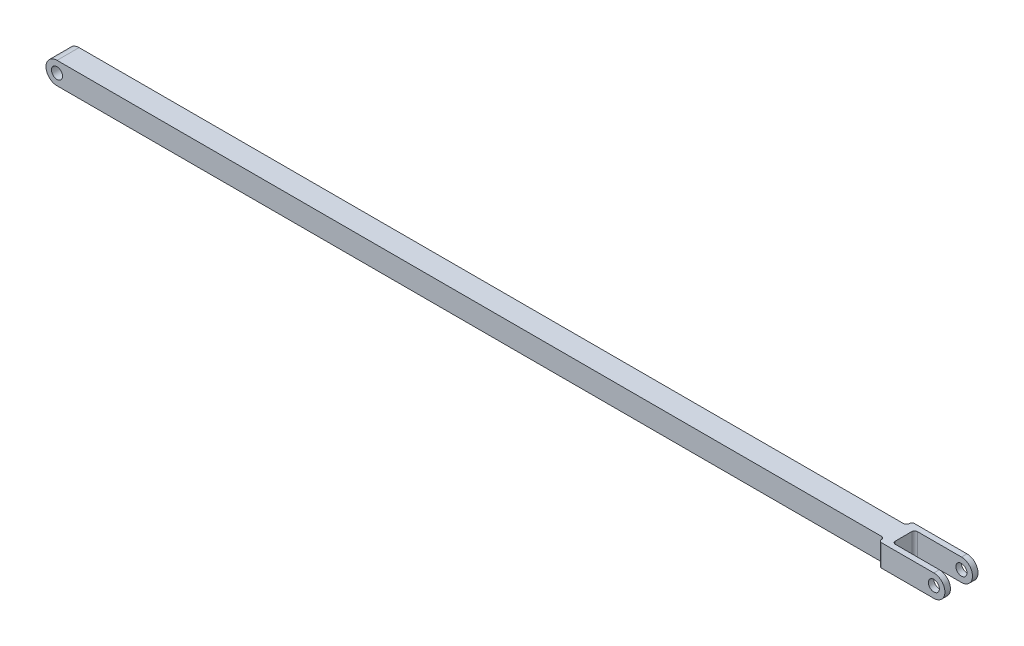
ISO-10303-21;
HEADER;
FILE_DESCRIPTION(('STEP AP214'),'2;1');
FILE_NAME('part.step','',(''),(''),'','','');
FILE_SCHEMA(('AUTOMOTIVE_DESIGN { 1 0 10303 214 1 1 1 1 }'));
ENDSEC;
DATA;
#1=APPLICATION_CONTEXT('core data for automotive mechanical design processes');
#2=APPLICATION_PROTOCOL_DEFINITION('international standard','automotive_design',2000,#1);
#3=PRODUCT_CONTEXT('',#1,'mechanical');
#4=PRODUCT('Part','Part','',(#3));
#5=PRODUCT_RELATED_PRODUCT_CATEGORY('part','',(#4));
#6=PRODUCT_DEFINITION_FORMATION('','',#4);
#7=PRODUCT_DEFINITION_CONTEXT('part definition',#1,'design');
#8=PRODUCT_DEFINITION('design','',#6,#7);
#9=PRODUCT_DEFINITION_SHAPE('','',#8);
#10=(LENGTH_UNIT() NAMED_UNIT(*) SI_UNIT(.MILLI.,.METRE.));
#11=(NAMED_UNIT(*) PLANE_ANGLE_UNIT() SI_UNIT($,.RADIAN.));
#12=(NAMED_UNIT(*) SI_UNIT($,.STERADIAN.) SOLID_ANGLE_UNIT());
#13=UNCERTAINTY_MEASURE_WITH_UNIT(LENGTH_MEASURE(1.E-05),#10,'distance_accuracy_value','');
#14=(GEOMETRIC_REPRESENTATION_CONTEXT(3) GLOBAL_UNCERTAINTY_ASSIGNED_CONTEXT((#13)) GLOBAL_UNIT_ASSIGNED_CONTEXT((#10,
#11,#12)) REPRESENTATION_CONTEXT('',''));
#15=CARTESIAN_POINT('',(0.,0.,0.));
#16=DIRECTION('',(0.,0.,1.));
#17=DIRECTION('',(1.,0.,0.));
#18=AXIS2_PLACEMENT_3D('',#15,#16,#17);
#19=CARTESIAN_POINT('',(520.7,-12.7,19.05));
#20=DIRECTION('',(0.,0.,-1.));
#21=DIRECTION('',(-1.,0.,0.));
#22=AXIS2_PLACEMENT_3D('',#19,#20,#21);
#23=PLANE('',#22);
#24=CARTESIAN_POINT('',(508.,0.,19.0500000000001));
#25=DIRECTION('',(0.,0.,1.));
#26=DIRECTION('',(1.,0.,0.));
#27=AXIS2_PLACEMENT_3D('',#24,#25,#26);
#28=CIRCLE('',#27,6.34999999999994);
#29=CARTESIAN_POINT('',(514.35,0.,19.0500000000001));
#30=VERTEX_POINT('',#29);
#31=EDGE_CURVE('E253',#30,#30,#28,.T.);
#32=ORIENTED_EDGE('',*,*,#31,.F.);
#33=EDGE_LOOP('',(#32));
#34=FACE_BOUND('',#33,.T.);
#35=DIRECTION('',(-1.,0.,0.));
#36=VECTOR('',#35,1.);
#37=CARTESIAN_POINT('',(520.7,12.7000000000002,19.05));
#38=LINE('',#37,#36);
#39=CARTESIAN_POINT('',(508.,12.7000000000002,19.0500000000001));
#40=VERTEX_POINT('',#39);
#41=CARTESIAN_POINT('',(447.675,12.7000000000002,19.05));
#42=VERTEX_POINT('',#41);
#43=EDGE_CURVE('E224',#40,#42,#38,.T.);
#44=ORIENTED_EDGE('',*,*,#43,.T.);
#45=DIRECTION('',(0.,1.,0.));
#46=VECTOR('',#45,1.);
#47=CARTESIAN_POINT('',(447.675,-12.7,19.05));
#48=LINE('',#47,#46);
#49=CARTESIAN_POINT('',(447.675,-12.7,19.05));
#50=VERTEX_POINT('',#49);
#51=EDGE_CURVE('E293',#42,#50,#48,.F.);
#52=ORIENTED_EDGE('',*,*,#51,.T.);
#53=DIRECTION('',(-1.,0.,0.));
#54=VECTOR('',#53,1.);
#55=CARTESIAN_POINT('',(520.7,-12.7,19.05));
#56=LINE('',#55,#54);
#57=CARTESIAN_POINT('',(508.,-12.7,19.0500000000001));
#58=VERTEX_POINT('',#57);
#59=EDGE_CURVE('E223',#58,#50,#56,.T.);
#60=ORIENTED_EDGE('',*,*,#59,.F.);
#61=CARTESIAN_POINT('',(508.,0.,19.0500000000001));
#62=DIRECTION('',(0.,0.,1.));
#63=DIRECTION('',(1.,0.,0.));
#64=AXIS2_PLACEMENT_3D('',#61,#62,#63);
#65=CIRCLE('',#64,12.6999999999999);
#66=EDGE_CURVE('E208',#58,#40,#65,.T.);
#67=ORIENTED_EDGE('',*,*,#66,.T.);
#68=EDGE_LOOP('',(#44,#52,#60,#67));
#69=FACE_BOUND('',#68,.T.);
#70=ADVANCED_FACE('F81',(#34,#69),#23,.F.);
#71=CARTESIAN_POINT('',(520.7,-12.7,-19.05));
#72=DIRECTION('',(0.,0.,-1.));
#73=DIRECTION('',(-1.,0.,0.));
#74=AXIS2_PLACEMENT_3D('',#71,#72,#73);
#75=PLANE('',#74);
#76=CARTESIAN_POINT('',(508.,0.,-19.05));
#77=DIRECTION('',(0.,0.,1.));
#78=DIRECTION('',(1.,0.,0.));
#79=AXIS2_PLACEMENT_3D('',#76,#77,#78);
#80=CIRCLE('',#79,6.34999999999994);
#81=CARTESIAN_POINT('',(514.35,0.,-19.05));
#82=VERTEX_POINT('',#81);
#83=EDGE_CURVE('E257',#82,#82,#80,.T.);
#84=ORIENTED_EDGE('',*,*,#83,.T.);
#85=EDGE_LOOP('',(#84));
#86=FACE_BOUND('',#85,.T.);
#87=DIRECTION('',(-1.,0.,0.));
#88=VECTOR('',#87,1.);
#89=CARTESIAN_POINT('',(520.7,-12.7,-19.05));
#90=LINE('',#89,#88);
#91=CARTESIAN_POINT('',(508.,-12.7,-19.05));
#92=VERTEX_POINT('',#91);
#93=CARTESIAN_POINT('',(447.675,-12.7,-19.05));
#94=VERTEX_POINT('',#93);
#95=EDGE_CURVE('E227',#92,#94,#90,.T.);
#96=ORIENTED_EDGE('',*,*,#95,.T.);
#97=DIRECTION('',(0.,1.,0.));
#98=VECTOR('',#97,1.);
#99=CARTESIAN_POINT('',(447.675,-12.7,-19.05));
#100=LINE('',#99,#98);
#101=CARTESIAN_POINT('',(447.675,12.7000000000002,-19.05));
#102=VERTEX_POINT('',#101);
#103=EDGE_CURVE('E222',#94,#102,#100,.T.);
#104=ORIENTED_EDGE('',*,*,#103,.T.);
#105=DIRECTION('',(-1.,0.,0.));
#106=VECTOR('',#105,1.);
#107=CARTESIAN_POINT('',(520.7,12.7000000000002,-19.05));
#108=LINE('',#107,#106);
#109=CARTESIAN_POINT('',(508.,12.7000000000002,-19.05));
#110=VERTEX_POINT('',#109);
#111=EDGE_CURVE('E213',#110,#102,#108,.T.);
#112=ORIENTED_EDGE('',*,*,#111,.F.);
#113=CARTESIAN_POINT('',(508.,0.,-19.05));
#114=DIRECTION('',(0.,0.,1.));
#115=DIRECTION('',(1.,0.,0.));
#116=AXIS2_PLACEMENT_3D('',#113,#114,#115);
#117=CIRCLE('',#116,12.6999999999999);
#118=EDGE_CURVE('E196',#92,#110,#117,.T.);
#119=ORIENTED_EDGE('',*,*,#118,.F.);
#120=EDGE_LOOP('',(#96,#104,#112,#119));
#121=FACE_BOUND('',#120,.T.);
#122=ADVANCED_FACE('F220',(#86,#121),#75,.T.);
#123=CARTESIAN_POINT('',(454.025,-12.7,-12.7));
#124=DIRECTION('',(0.,0.,1.));
#125=DIRECTION('',(1.,0.,0.));
#126=AXIS2_PLACEMENT_3D('',#123,#124,#125);
#127=PLANE('',#126);
#128=CARTESIAN_POINT('',(508.,0.,-12.7));
#129=DIRECTION('',(0.,0.,1.));
#130=DIRECTION('',(1.,0.,0.));
#131=AXIS2_PLACEMENT_3D('',#128,#129,#130);
#132=CIRCLE('',#131,6.34999999999994);
#133=CARTESIAN_POINT('',(514.35,0.,-12.7));
#134=VERTEX_POINT('',#133);
#135=EDGE_CURVE('E217',#134,#134,#132,.T.);
#136=ORIENTED_EDGE('',*,*,#135,.F.);
#137=EDGE_LOOP('',(#136));
#138=FACE_BOUND('',#137,.T.);
#139=DIRECTION('',(1.,0.,0.));
#140=VECTOR('',#139,1.);
#141=CARTESIAN_POINT('',(454.025,12.7000000000002,-12.7));
#142=LINE('',#141,#140);
#143=CARTESIAN_POINT('',(457.2,12.7000000000002,-12.7));
#144=VERTEX_POINT('',#143);
#145=CARTESIAN_POINT('',(508.,12.7000000000002,-12.7));
#146=VERTEX_POINT('',#145);
#147=EDGE_CURVE('E215',#144,#146,#142,.T.);
#148=ORIENTED_EDGE('',*,*,#147,.F.);
#149=DIRECTION('',(0.,1.,0.));
#150=VECTOR('',#149,1.);
#151=CARTESIAN_POINT('',(457.2,-12.7,-12.7));
#152=LINE('',#151,#150);
#153=CARTESIAN_POINT('',(457.2,-12.7,-12.7));
#154=VERTEX_POINT('',#153);
#155=EDGE_CURVE('E291',#144,#154,#152,.F.);
#156=ORIENTED_EDGE('',*,*,#155,.T.);
#157=DIRECTION('',(1.,0.,0.));
#158=VECTOR('',#157,1.);
#159=CARTESIAN_POINT('',(454.025,-12.7,-12.7));
#160=LINE('',#159,#158);
#161=CARTESIAN_POINT('',(508.,-12.7,-12.7));
#162=VERTEX_POINT('',#161);
#163=EDGE_CURVE('E230',#154,#162,#160,.T.);
#164=ORIENTED_EDGE('',*,*,#163,.T.);
#165=CARTESIAN_POINT('',(508.,0.,-12.7));
#166=DIRECTION('',(0.,0.,1.));
#167=DIRECTION('',(1.,0.,0.));
#168=AXIS2_PLACEMENT_3D('',#165,#166,#167);
#169=CIRCLE('',#168,12.6999999999999);
#170=EDGE_CURVE('E369',#162,#146,#169,.T.);
#171=ORIENTED_EDGE('',*,*,#170,.T.);
#172=EDGE_LOOP('',(#148,#156,#164,#171));
#173=FACE_BOUND('',#172,.T.);
#174=ADVANCED_FACE('F403',(#138,#173),#127,.T.);
#175=CARTESIAN_POINT('',(454.025,-12.7,12.7));
#176=DIRECTION('',(0.,0.,1.));
#177=DIRECTION('',(1.,0.,0.));
#178=AXIS2_PLACEMENT_3D('',#175,#176,#177);
#179=PLANE('',#178);
#180=CARTESIAN_POINT('',(508.,0.,12.7));
#181=DIRECTION('',(0.,0.,1.));
#182=DIRECTION('',(1.,0.,0.));
#183=AXIS2_PLACEMENT_3D('',#180,#181,#182);
#184=CIRCLE('',#183,6.34999999999994);
#185=CARTESIAN_POINT('',(514.35,0.,12.7));
#186=VERTEX_POINT('',#185);
#187=EDGE_CURVE('E256',#186,#186,#184,.T.);
#188=ORIENTED_EDGE('',*,*,#187,.T.);
#189=EDGE_LOOP('',(#188));
#190=FACE_BOUND('',#189,.T.);
#191=DIRECTION('',(1.,0.,0.));
#192=VECTOR('',#191,1.);
#193=CARTESIAN_POINT('',(454.025,-12.7,12.7));
#194=LINE('',#193,#192);
#195=CARTESIAN_POINT('',(457.2,-12.7,12.7));
#196=VERTEX_POINT('',#195);
#197=CARTESIAN_POINT('',(508.,-12.7,12.7));
#198=VERTEX_POINT('',#197);
#199=EDGE_CURVE('E367',#196,#198,#194,.T.);
#200=ORIENTED_EDGE('',*,*,#199,.F.);
#201=DIRECTION('',(0.,1.,0.));
#202=VECTOR('',#201,1.);
#203=CARTESIAN_POINT('',(457.2,12.7000000000002,12.7));
#204=LINE('',#203,#202);
#205=CARTESIAN_POINT('',(457.2,12.7000000000002,12.7));
#206=VERTEX_POINT('',#205);
#207=EDGE_CURVE('E269',#196,#206,#204,.T.);
#208=ORIENTED_EDGE('',*,*,#207,.T.);
#209=DIRECTION('',(1.,0.,0.));
#210=VECTOR('',#209,1.);
#211=CARTESIAN_POINT('',(454.025,12.7000000000002,12.7));
#212=LINE('',#211,#210);
#213=CARTESIAN_POINT('',(508.,12.7000000000002,12.7));
#214=VERTEX_POINT('',#213);
#215=EDGE_CURVE('E380',#206,#214,#212,.T.);
#216=ORIENTED_EDGE('',*,*,#215,.T.);
#217=CARTESIAN_POINT('',(508.,0.,12.7));
#218=DIRECTION('',(0.,0.,1.));
#219=DIRECTION('',(1.,0.,0.));
#220=AXIS2_PLACEMENT_3D('',#217,#218,#219);
#221=CIRCLE('',#220,12.6999999999999);
#222=EDGE_CURVE('E335',#198,#214,#221,.T.);
#223=ORIENTED_EDGE('',*,*,#222,.F.);
#224=EDGE_LOOP('',(#200,#208,#216,#223));
#225=FACE_BOUND('',#224,.T.);
#226=ADVANCED_FACE('F434',(#190,#225),#179,.F.);
#227=CARTESIAN_POINT('',(-508.,12.7,12.7));
#228=DIRECTION('',(0.,-1.,0.));
#229=DIRECTION('',(1.,0.,0.));
#230=AXIS2_PLACEMENT_3D('',#227,#228,#229);
#231=PLANE('',#230);
#232=ORIENTED_EDGE('',*,*,#111,.T.);
#233=CARTESIAN_POINT('',(447.675,12.7000000000002,-15.875));
#234=DIRECTION('',(0.,-1.,0.));
#235=DIRECTION('',(1.,0.,0.));
#236=AXIS2_PLACEMENT_3D('',#233,#234,#235);
#237=CIRCLE('',#236,3.175);
#238=CARTESIAN_POINT('',(444.5,12.7000000000002,-15.875));
#239=VERTEX_POINT('',#238);
#240=EDGE_CURVE('E281',#102,#239,#237,.F.);
#241=ORIENTED_EDGE('',*,*,#240,.T.);
#242=CARTESIAN_POINT('',(441.325,12.7000000000002,-15.875));
#243=DIRECTION('',(0.,-1.,0.));
#244=DIRECTION('',(1.,0.,0.));
#245=AXIS2_PLACEMENT_3D('',#242,#243,#244);
#246=CIRCLE('',#245,3.175);
#247=CARTESIAN_POINT('',(441.325,12.7000000000002,-12.7));
#248=VERTEX_POINT('',#247);
#249=EDGE_CURVE('E300',#239,#248,#246,.T.);
#250=ORIENTED_EDGE('',*,*,#249,.T.);
#251=DIRECTION('',(-1.,0.,0.));
#252=VECTOR('',#251,1.);
#253=CARTESIAN_POINT('',(-508.,12.7,-12.7));
#254=LINE('',#253,#252);
#255=CARTESIAN_POINT('',(-508.,12.7,-12.7));
#256=VERTEX_POINT('',#255);
#257=EDGE_CURVE('E345',#248,#256,#254,.T.);
#258=ORIENTED_EDGE('',*,*,#257,.T.);
#259=DIRECTION('',(0.,0.,-1.));
#260=VECTOR('',#259,1.);
#261=CARTESIAN_POINT('',(-508.,12.7,12.7));
#262=LINE('',#261,#260);
#263=CARTESIAN_POINT('',(-508.,12.7,12.7));
#264=VERTEX_POINT('',#263);
#265=EDGE_CURVE('E339',#264,#256,#262,.T.);
#266=ORIENTED_EDGE('',*,*,#265,.F.);
#267=DIRECTION('',(-1.,0.,0.));
#268=VECTOR('',#267,1.);
#269=CARTESIAN_POINT('',(-508.,12.7,12.7));
#270=LINE('',#269,#268);
#271=CARTESIAN_POINT('',(441.325,12.7000000000002,12.7));
#272=VERTEX_POINT('',#271);
#273=EDGE_CURVE('E344',#272,#264,#270,.T.);
#274=ORIENTED_EDGE('',*,*,#273,.F.);
#275=CARTESIAN_POINT('',(441.325,12.7000000000002,15.875));
#276=DIRECTION('',(0.,-1.,0.));
#277=DIRECTION('',(1.,0.,0.));
#278=AXIS2_PLACEMENT_3D('',#275,#276,#277);
#279=CIRCLE('',#278,3.175);
#280=CARTESIAN_POINT('',(444.5,12.7000000000002,15.875));
#281=VERTEX_POINT('',#280);
#282=EDGE_CURVE('E304',#272,#281,#279,.T.);
#283=ORIENTED_EDGE('',*,*,#282,.T.);
#284=CARTESIAN_POINT('',(447.675,12.7000000000002,15.875));
#285=DIRECTION('',(0.,-1.,0.));
#286=DIRECTION('',(1.,0.,0.));
#287=AXIS2_PLACEMENT_3D('',#284,#285,#286);
#288=CIRCLE('',#287,3.175);
#289=EDGE_CURVE('E279',#281,#42,#288,.F.);
#290=ORIENTED_EDGE('',*,*,#289,.T.);
#291=ORIENTED_EDGE('',*,*,#43,.F.);
#292=DIRECTION('',(0.,0.,1.));
#293=VECTOR('',#292,1.);
#294=CARTESIAN_POINT('',(508.,12.7,-19.05));
#295=LINE('',#294,#293);
#296=EDGE_CURVE('E267',#214,#40,#295,.T.);
#297=ORIENTED_EDGE('',*,*,#296,.F.);
#298=ORIENTED_EDGE('',*,*,#215,.F.);
#299=CARTESIAN_POINT('',(457.2,12.7000000000002,9.52499999999998));
#300=DIRECTION('',(0.,-1.,0.));
#301=DIRECTION('',(1.,0.,0.));
#302=AXIS2_PLACEMENT_3D('',#299,#300,#301);
#303=CIRCLE('',#302,3.175);
#304=CARTESIAN_POINT('',(454.025,12.7000000000002,9.52499999999997));
#305=VERTEX_POINT('',#304);
#306=EDGE_CURVE('E295',#206,#305,#303,.T.);
#307=ORIENTED_EDGE('',*,*,#306,.T.);
#308=DIRECTION('',(0.,0.,1.));
#309=VECTOR('',#308,1.);
#310=CARTESIAN_POINT('',(454.025,12.7000000000002,-12.7));
#311=LINE('',#310,#309);
#312=CARTESIAN_POINT('',(454.025,12.7000000000002,-9.52500000000003));
#313=VERTEX_POINT('',#312);
#314=EDGE_CURVE('E372',#313,#305,#311,.T.);
#315=ORIENTED_EDGE('',*,*,#314,.F.);
#316=CARTESIAN_POINT('',(457.2,12.7000000000002,-9.52500000000003));
#317=DIRECTION('',(0.,-1.,0.));
#318=DIRECTION('',(1.,0.,0.));
#319=AXIS2_PLACEMENT_3D('',#316,#317,#318);
#320=CIRCLE('',#319,3.175);
#321=EDGE_CURVE('E90',#313,#144,#320,.T.);
#322=ORIENTED_EDGE('',*,*,#321,.T.);
#323=ORIENTED_EDGE('',*,*,#147,.T.);
#324=DIRECTION('',(0.,0.,1.));
#325=VECTOR('',#324,1.);
#326=CARTESIAN_POINT('',(508.,12.7000000000002,-19.05));
#327=LINE('',#326,#325);
#328=EDGE_CURVE('E200',#110,#146,#327,.T.);
#329=ORIENTED_EDGE('',*,*,#328,.F.);
#330=EDGE_LOOP('',(#232,#241,#250,#258,#266,#274,#283,#290,#291,#297,#298,#307,#315,#322,#323,#329));
#331=FACE_BOUND('',#330,.T.);
#332=ADVANCED_FACE('F212',(#331),#231,.F.);
#333=CARTESIAN_POINT('',(-508.,-12.7,12.7));
#334=DIRECTION('',(0.,1.,0.));
#335=DIRECTION('',(-1.,0.,0.));
#336=AXIS2_PLACEMENT_3D('',#333,#334,#335);
#337=PLANE('',#336);
#338=DIRECTION('',(1.,0.,0.));
#339=VECTOR('',#338,1.);
#340=CARTESIAN_POINT('',(-508.,-12.7,-12.7));
#341=LINE('',#340,#339);
#342=CARTESIAN_POINT('',(-508.,-12.7,-12.7));
#343=VERTEX_POINT('',#342);
#344=CARTESIAN_POINT('',(441.325,-12.6999999999998,-12.7));
#345=VERTEX_POINT('',#344);
#346=EDGE_CURVE('E348',#343,#345,#341,.T.);
#347=ORIENTED_EDGE('',*,*,#346,.T.);
#348=CARTESIAN_POINT('',(441.325,-12.6999999999998,-15.875));
#349=DIRECTION('',(0.,1.,0.));
#350=DIRECTION('',(-1.,0.,0.));
#351=AXIS2_PLACEMENT_3D('',#348,#349,#350);
#352=CIRCLE('',#351,3.175);
#353=CARTESIAN_POINT('',(444.5,-12.7,-15.875));
#354=VERTEX_POINT('',#353);
#355=EDGE_CURVE('E98',#345,#354,#352,.T.);
#356=ORIENTED_EDGE('',*,*,#355,.T.);
#357=CARTESIAN_POINT('',(447.675,-12.6999999999998,-15.875));
#358=DIRECTION('',(0.,1.,0.));
#359=DIRECTION('',(-1.,0.,0.));
#360=AXIS2_PLACEMENT_3D('',#357,#358,#359);
#361=CIRCLE('',#360,3.175);
#362=EDGE_CURVE('E285',#354,#94,#361,.F.);
#363=ORIENTED_EDGE('',*,*,#362,.T.);
#364=ORIENTED_EDGE('',*,*,#95,.F.);
#365=DIRECTION('',(0.,0.,1.));
#366=VECTOR('',#365,1.);
#367=CARTESIAN_POINT('',(508.,-12.7,-19.05));
#368=LINE('',#367,#366);
#369=EDGE_CURVE('E202',#92,#162,#368,.T.);
#370=ORIENTED_EDGE('',*,*,#369,.T.);
#371=ORIENTED_EDGE('',*,*,#163,.F.);
#372=CARTESIAN_POINT('',(457.2,-12.6999999999998,-9.52500000000003));
#373=DIRECTION('',(0.,1.,0.));
#374=DIRECTION('',(-1.,0.,0.));
#375=AXIS2_PLACEMENT_3D('',#372,#373,#374);
#376=CIRCLE('',#375,3.175);
#377=CARTESIAN_POINT('',(454.025,-12.7,-9.52500000000003));
#378=VERTEX_POINT('',#377);
#379=EDGE_CURVE('E13',#154,#378,#376,.T.);
#380=ORIENTED_EDGE('',*,*,#379,.T.);
#381=DIRECTION('',(0.,0.,1.));
#382=VECTOR('',#381,1.);
#383=CARTESIAN_POINT('',(454.025,-12.7,-12.7));
#384=LINE('',#383,#382);
#385=CARTESIAN_POINT('',(454.025,-12.7,9.52499999999997));
#386=VERTEX_POINT('',#385);
#387=EDGE_CURVE('E373',#378,#386,#384,.T.);
#388=ORIENTED_EDGE('',*,*,#387,.T.);
#389=CARTESIAN_POINT('',(457.2,-12.6999999999998,9.52499999999998));
#390=DIRECTION('',(0.,1.,0.));
#391=DIRECTION('',(-1.,0.,0.));
#392=AXIS2_PLACEMENT_3D('',#389,#390,#391);
#393=CIRCLE('',#392,3.175);
#394=EDGE_CURVE('E297',#386,#196,#393,.T.);
#395=ORIENTED_EDGE('',*,*,#394,.T.);
#396=ORIENTED_EDGE('',*,*,#199,.T.);
#397=EDGE_CURVE('E207',#198,#58,#368,.T.);
#398=ORIENTED_EDGE('',*,*,#397,.T.);
#399=ORIENTED_EDGE('',*,*,#59,.T.);
#400=CARTESIAN_POINT('',(447.675,-12.6999999999998,15.875));
#401=DIRECTION('',(0.,1.,0.));
#402=DIRECTION('',(-1.,0.,0.));
#403=AXIS2_PLACEMENT_3D('',#400,#401,#402);
#404=CIRCLE('',#403,3.175);
#405=CARTESIAN_POINT('',(444.5,-12.7,15.875));
#406=VERTEX_POINT('',#405);
#407=EDGE_CURVE('E283',#50,#406,#404,.F.);
#408=ORIENTED_EDGE('',*,*,#407,.T.);
#409=CARTESIAN_POINT('',(441.325,-12.6999999999998,15.875));
#410=DIRECTION('',(0.,1.,0.));
#411=DIRECTION('',(-1.,0.,0.));
#412=AXIS2_PLACEMENT_3D('',#409,#410,#411);
#413=CIRCLE('',#412,3.175);
#414=CARTESIAN_POINT('',(441.325,-12.6999999999998,12.7));
#415=VERTEX_POINT('',#414);
#416=EDGE_CURVE('E302',#406,#415,#413,.T.);
#417=ORIENTED_EDGE('',*,*,#416,.T.);
#418=DIRECTION('',(1.,0.,0.));
#419=VECTOR('',#418,1.);
#420=CARTESIAN_POINT('',(-508.,-12.7,12.7));
#421=LINE('',#420,#419);
#422=CARTESIAN_POINT('',(-508.,-12.7,12.7));
#423=VERTEX_POINT('',#422);
#424=EDGE_CURVE('E353',#423,#415,#421,.T.);
#425=ORIENTED_EDGE('',*,*,#424,.F.);
#426=DIRECTION('',(0.,0.,-1.));
#427=VECTOR('',#426,1.);
#428=CARTESIAN_POINT('',(-508.,-12.7,12.7));
#429=LINE('',#428,#427);
#430=EDGE_CURVE('E337',#423,#343,#429,.T.);
#431=ORIENTED_EDGE('',*,*,#430,.T.);
#432=EDGE_LOOP('',(#347,#356,#363,#364,#370,#371,#380,#388,#395,#396,#398,#399,#408,#417,#425,#431));
#433=FACE_BOUND('',#432,.T.);
#434=ADVANCED_FACE('F365',(#433),#337,.F.);
#435=CARTESIAN_POINT('',(-508.,0.,12.7));
#436=DIRECTION('',(0.,0.,-1.));
#437=DIRECTION('',(-1.,0.,0.));
#438=AXIS2_PLACEMENT_3D('',#435,#436,#437);
#439=CYLINDRICAL_SURFACE('',#438,12.7);
#440=CARTESIAN_POINT('',(-508.,0.,-12.7));
#441=DIRECTION('',(0.,0.,1.));
#442=DIRECTION('',(1.,0.,0.));
#443=AXIS2_PLACEMENT_3D('',#440,#441,#442);
#444=CIRCLE('',#443,12.7);
#445=EDGE_CURVE('E238',#256,#343,#444,.T.);
#446=ORIENTED_EDGE('',*,*,#445,.T.);
#447=ORIENTED_EDGE('',*,*,#430,.F.);
#448=CARTESIAN_POINT('',(-508.,0.,12.7));
#449=DIRECTION('',(0.,0.,1.));
#450=DIRECTION('',(1.,0.,0.));
#451=AXIS2_PLACEMENT_3D('',#448,#449,#450);
#452=CIRCLE('',#451,12.7);
#453=EDGE_CURVE('E347',#264,#423,#452,.T.);
#454=ORIENTED_EDGE('',*,*,#453,.F.);
#455=ORIENTED_EDGE('',*,*,#265,.T.);
#456=EDGE_LOOP('',(#446,#447,#454,#455));
#457=FACE_BOUND('',#456,.T.);
#458=ADVANCED_FACE('F363',(#457),#439,.T.);
#459=CARTESIAN_POINT('',(-508.,0.,12.7));
#460=DIRECTION('',(0.,0.,1.));
#461=DIRECTION('',(1.,0.,0.));
#462=AXIS2_PLACEMENT_3D('',#459,#460,#461);
#463=PLANE('',#462);
#464=ORIENTED_EDGE('',*,*,#424,.T.);
#465=DIRECTION('',(0.,-1.,0.));
#466=VECTOR('',#465,1.);
#467=CARTESIAN_POINT('',(441.325,12.7000000000002,12.7));
#468=LINE('',#467,#466);
#469=EDGE_CURVE('E288',#415,#272,#468,.F.);
#470=ORIENTED_EDGE('',*,*,#469,.T.);
#471=ORIENTED_EDGE('',*,*,#273,.T.);
#472=ORIENTED_EDGE('',*,*,#453,.T.);
#473=EDGE_LOOP('',(#464,#470,#471,#472));
#474=FACE_BOUND('',#473,.T.);
#475=CARTESIAN_POINT('',(-508.,0.,12.7));
#476=DIRECTION('',(0.,0.,1.));
#477=DIRECTION('',(1.,0.,0.));
#478=AXIS2_PLACEMENT_3D('',#475,#476,#477);
#479=CIRCLE('',#478,6.35000000000017);
#480=CARTESIAN_POINT('',(-501.65,0.,12.7));
#481=VERTEX_POINT('',#480);
#482=EDGE_CURVE('E239',#481,#481,#479,.T.);
#483=ORIENTED_EDGE('',*,*,#482,.F.);
#484=EDGE_LOOP('',(#483));
#485=FACE_BOUND('',#484,.T.);
#486=ADVANCED_FACE('F359',(#474,#485),#463,.T.);
#487=CARTESIAN_POINT('',(-508.,0.,-12.7));
#488=DIRECTION('',(0.,0.,1.));
#489=DIRECTION('',(1.,0.,0.));
#490=AXIS2_PLACEMENT_3D('',#487,#488,#489);
#491=PLANE('',#490);
#492=CARTESIAN_POINT('',(-508.,0.,-12.7));
#493=DIRECTION('',(0.,0.,1.));
#494=DIRECTION('',(1.,0.,0.));
#495=AXIS2_PLACEMENT_3D('',#492,#493,#494);
#496=CIRCLE('',#495,6.35000000000017);
#497=CARTESIAN_POINT('',(-501.65,0.,-12.7));
#498=VERTEX_POINT('',#497);
#499=EDGE_CURVE('E234',#498,#498,#496,.T.);
#500=ORIENTED_EDGE('',*,*,#499,.T.);
#501=EDGE_LOOP('',(#500));
#502=FACE_BOUND('',#501,.T.);
#503=ORIENTED_EDGE('',*,*,#257,.F.);
#504=DIRECTION('',(0.,-1.,0.));
#505=VECTOR('',#504,1.);
#506=CARTESIAN_POINT('',(441.325,1.72894106439022E-13,-12.7));
#507=LINE('',#506,#505);
#508=EDGE_CURVE('E106',#248,#345,#507,.T.);
#509=ORIENTED_EDGE('',*,*,#508,.T.);
#510=ORIENTED_EDGE('',*,*,#346,.F.);
#511=ORIENTED_EDGE('',*,*,#445,.F.);
#512=EDGE_LOOP('',(#503,#509,#510,#511));
#513=FACE_BOUND('',#512,.T.);
#514=ADVANCED_FACE('F387',(#502,#513),#491,.F.);
#515=CARTESIAN_POINT('',(-508.,0.,-12.7));
#516=DIRECTION('',(0.,0.,1.));
#517=DIRECTION('',(1.,0.,0.));
#518=AXIS2_PLACEMENT_3D('',#515,#516,#517);
#519=CYLINDRICAL_SURFACE('',#518,6.35000000000017);
#520=ORIENTED_EDGE('',*,*,#499,.F.);
#521=EDGE_LOOP('',(#520));
#522=FACE_BOUND('',#521,.T.);
#523=ORIENTED_EDGE('',*,*,#482,.T.);
#524=EDGE_LOOP('',(#523));
#525=FACE_BOUND('',#524,.T.);
#526=ADVANCED_FACE('F385',(#522,#525),#519,.F.);
#527=CARTESIAN_POINT('',(454.025,-12.7,-12.7));
#528=DIRECTION('',(-1.,0.,0.));
#529=DIRECTION('',(0.,-1.,0.));
#530=AXIS2_PLACEMENT_3D('',#527,#528,#529);
#531=PLANE('',#530);
#532=ORIENTED_EDGE('',*,*,#314,.T.);
#533=DIRECTION('',(0.,1.,0.));
#534=VECTOR('',#533,1.);
#535=CARTESIAN_POINT('',(454.025,-12.7,9.52499999999998));
#536=LINE('',#535,#534);
#537=EDGE_CURVE('E276',#305,#386,#536,.F.);
#538=ORIENTED_EDGE('',*,*,#537,.T.);
#539=ORIENTED_EDGE('',*,*,#387,.F.);
#540=DIRECTION('',(0.,1.,0.));
#541=VECTOR('',#540,1.);
#542=CARTESIAN_POINT('',(454.025,-12.7,-9.52500000000003));
#543=LINE('',#542,#541);
#544=EDGE_CURVE('E273',#378,#313,#543,.T.);
#545=ORIENTED_EDGE('',*,*,#544,.T.);
#546=EDGE_LOOP('',(#532,#538,#539,#545));
#547=FACE_BOUND('',#546,.T.);
#548=ADVANCED_FACE('F409',(#547),#531,.F.);
#549=CARTESIAN_POINT('',(508.,0.,-19.05));
#550=DIRECTION('',(0.,0.,1.));
#551=DIRECTION('',(1.,0.,0.));
#552=AXIS2_PLACEMENT_3D('',#549,#550,#551);
#553=CYLINDRICAL_SURFACE('',#552,12.6999999999999);
#554=ORIENTED_EDGE('',*,*,#222,.T.);
#555=ORIENTED_EDGE('',*,*,#296,.T.);
#556=ORIENTED_EDGE('',*,*,#66,.F.);
#557=ORIENTED_EDGE('',*,*,#397,.F.);
#558=EDGE_LOOP('',(#554,#555,#556,#557));
#559=FACE_BOUND('',#558,.T.);
#560=ADVANCED_FACE('F333',(#559),#553,.T.);
#561=ORIENTED_EDGE('',*,*,#369,.F.);
#562=ORIENTED_EDGE('',*,*,#118,.T.);
#563=ORIENTED_EDGE('',*,*,#328,.T.);
#564=ORIENTED_EDGE('',*,*,#170,.F.);
#565=EDGE_LOOP('',(#561,#562,#563,#564));
#566=FACE_BOUND('',#565,.T.);
#567=ADVANCED_FACE('F198',(#566),#553,.T.);
#568=CARTESIAN_POINT('',(508.,0.,-19.05));
#569=DIRECTION('',(0.,0.,1.));
#570=DIRECTION('',(1.,0.,0.));
#571=AXIS2_PLACEMENT_3D('',#568,#569,#570);
#572=CYLINDRICAL_SURFACE('',#571,6.34999999999994);
#573=ORIENTED_EDGE('',*,*,#31,.T.);
#574=EDGE_LOOP('',(#573));
#575=FACE_BOUND('',#574,.T.);
#576=ORIENTED_EDGE('',*,*,#187,.F.);
#577=EDGE_LOOP('',(#576));
#578=FACE_BOUND('',#577,.T.);
#579=ADVANCED_FACE('F448',(#575,#578),#572,.F.);
#580=ORIENTED_EDGE('',*,*,#135,.T.);
#581=EDGE_LOOP('',(#580));
#582=FACE_BOUND('',#581,.T.);
#583=ORIENTED_EDGE('',*,*,#83,.F.);
#584=EDGE_LOOP('',(#583));
#585=FACE_BOUND('',#584,.T.);
#586=ADVANCED_FACE('F449',(#582,#585),#572,.F.);
#587=CARTESIAN_POINT('',(457.2,-12.7,9.52499999999998));
#588=DIRECTION('',(0.,-1.,0.));
#589=DIRECTION('',(1.,0.,0.));
#590=AXIS2_PLACEMENT_3D('',#587,#588,#589);
#591=CYLINDRICAL_SURFACE('',#590,3.175);
#592=ORIENTED_EDGE('',*,*,#394,.F.);
#593=ORIENTED_EDGE('',*,*,#537,.F.);
#594=ORIENTED_EDGE('',*,*,#306,.F.);
#595=ORIENTED_EDGE('',*,*,#207,.F.);
#596=EDGE_LOOP('',(#592,#593,#594,#595));
#597=FACE_BOUND('',#596,.T.);
#598=ADVANCED_FACE('F432',(#597),#591,.F.);
#599=CARTESIAN_POINT('',(441.325,1.72894106439022E-13,-15.875));
#600=DIRECTION('',(0.,-1.,0.));
#601=DIRECTION('',(1.,0.,0.));
#602=AXIS2_PLACEMENT_3D('',#599,#600,#601);
#603=CYLINDRICAL_SURFACE('',#602,3.175);
#604=DIRECTION('',(0.,-1.,0.));
#605=VECTOR('',#604,1.);
#606=CARTESIAN_POINT('',(444.5,-12.7,-15.875));
#607=LINE('',#606,#605);
#608=EDGE_CURVE('E306',#354,#239,#607,.F.);
#609=ORIENTED_EDGE('',*,*,#608,.F.);
#610=ORIENTED_EDGE('',*,*,#355,.F.);
#611=ORIENTED_EDGE('',*,*,#508,.F.);
#612=ORIENTED_EDGE('',*,*,#249,.F.);
#613=EDGE_LOOP('',(#609,#610,#611,#612));
#614=FACE_BOUND('',#613,.T.);
#615=ADVANCED_FACE('F418',(#614),#603,.F.);
#616=CARTESIAN_POINT('',(447.675,-12.7,-15.875));
#617=DIRECTION('',(0.,1.,0.));
#618=DIRECTION('',(-1.,0.,0.));
#619=AXIS2_PLACEMENT_3D('',#616,#617,#618);
#620=CYLINDRICAL_SURFACE('',#619,3.175);
#621=ORIENTED_EDGE('',*,*,#362,.F.);
#622=ORIENTED_EDGE('',*,*,#608,.T.);
#623=ORIENTED_EDGE('',*,*,#240,.F.);
#624=ORIENTED_EDGE('',*,*,#103,.F.);
#625=EDGE_LOOP('',(#621,#622,#623,#624));
#626=FACE_BOUND('',#625,.T.);
#627=ADVANCED_FACE('F419',(#626),#620,.T.);
#628=CARTESIAN_POINT('',(447.675,-12.7,15.875));
#629=DIRECTION('',(0.,-1.,0.));
#630=DIRECTION('',(1.,0.,0.));
#631=AXIS2_PLACEMENT_3D('',#628,#629,#630);
#632=CYLINDRICAL_SURFACE('',#631,3.175);
#633=ORIENTED_EDGE('',*,*,#51,.F.);
#634=ORIENTED_EDGE('',*,*,#289,.F.);
#635=DIRECTION('',(0.,1.,0.));
#636=VECTOR('',#635,1.);
#637=CARTESIAN_POINT('',(444.5,12.7000000000002,15.875));
#638=LINE('',#637,#636);
#639=EDGE_CURVE('E85',#406,#281,#638,.T.);
#640=ORIENTED_EDGE('',*,*,#639,.F.);
#641=ORIENTED_EDGE('',*,*,#407,.F.);
#642=EDGE_LOOP('',(#633,#634,#640,#641));
#643=FACE_BOUND('',#642,.T.);
#644=ADVANCED_FACE('F321',(#643),#632,.T.);
#645=CARTESIAN_POINT('',(441.325,-12.7,15.875));
#646=DIRECTION('',(0.,1.,0.));
#647=DIRECTION('',(-1.,0.,0.));
#648=AXIS2_PLACEMENT_3D('',#645,#646,#647);
#649=CYLINDRICAL_SURFACE('',#648,3.175);
#650=ORIENTED_EDGE('',*,*,#282,.F.);
#651=ORIENTED_EDGE('',*,*,#469,.F.);
#652=ORIENTED_EDGE('',*,*,#416,.F.);
#653=ORIENTED_EDGE('',*,*,#639,.T.);
#654=EDGE_LOOP('',(#650,#651,#652,#653));
#655=FACE_BOUND('',#654,.T.);
#656=ADVANCED_FACE('F315',(#655),#649,.F.);
#657=CARTESIAN_POINT('',(457.2,-12.7,-9.52500000000003));
#658=DIRECTION('',(0.,1.,0.));
#659=DIRECTION('',(-1.,0.,0.));
#660=AXIS2_PLACEMENT_3D('',#657,#658,#659);
#661=CYLINDRICAL_SURFACE('',#660,3.175);
#662=ORIENTED_EDGE('',*,*,#379,.F.);
#663=ORIENTED_EDGE('',*,*,#155,.F.);
#664=ORIENTED_EDGE('',*,*,#321,.F.);
#665=ORIENTED_EDGE('',*,*,#544,.F.);
#666=EDGE_LOOP('',(#662,#663,#664,#665));
#667=FACE_BOUND('',#666,.T.);
#668=ADVANCED_FACE('F83',(#667),#661,.F.);
#669=CLOSED_SHELL('',(#70,#122,#174,#226,#332,#434,#458,#486,#514,#526,#548,#560,#567,#579,#586,
#598,#615,#627,#644,#656,#668));
#670=MANIFOLD_SOLID_BREP('B2',#669);
#671=ADVANCED_BREP_SHAPE_REPRESENTATION('',(#18,#670),#14);
#672=SHAPE_DEFINITION_REPRESENTATION(#9,#671);
ENDSEC;
END-ISO-10303-21;
